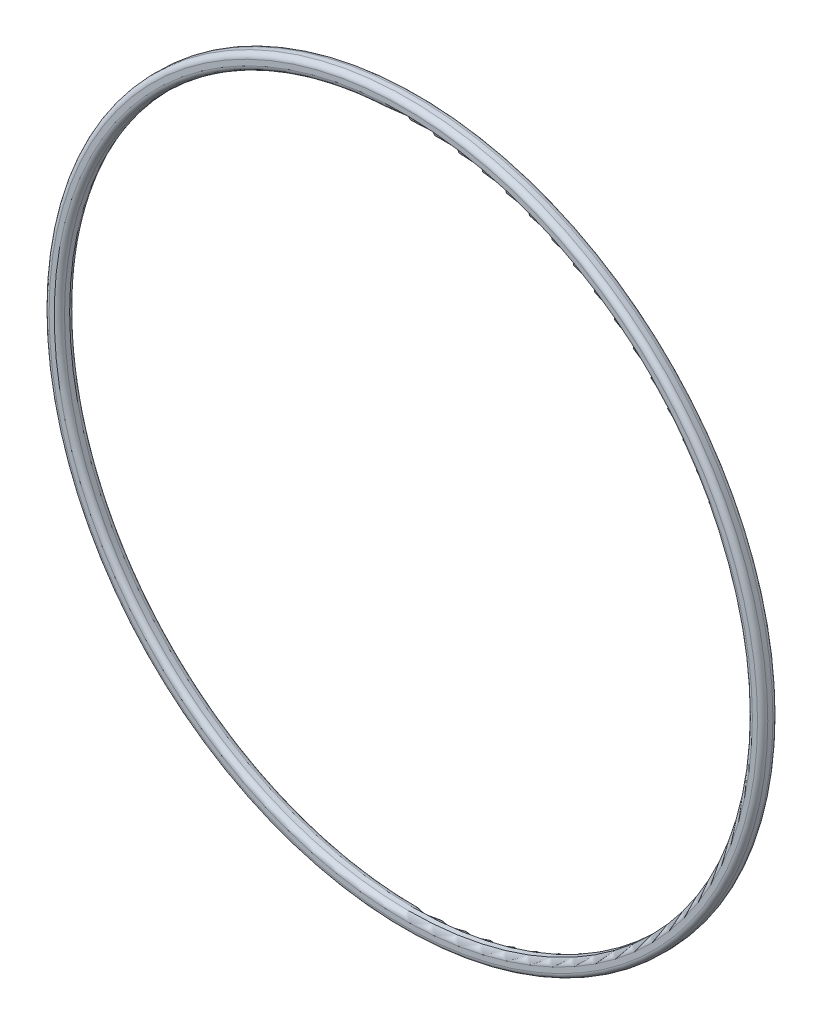
ISO-10303-21;
HEADER;
FILE_DESCRIPTION(('STEP AP214'),'2;1');
FILE_NAME('part.step','',(''),(''),'','','');
FILE_SCHEMA(('AUTOMOTIVE_DESIGN { 1 0 10303 214 1 1 1 1 }'));
ENDSEC;
DATA;
#1=APPLICATION_CONTEXT('core data for automotive mechanical design processes');
#2=APPLICATION_PROTOCOL_DEFINITION('international standard','automotive_design',2000,#1);
#3=PRODUCT_CONTEXT('',#1,'mechanical');
#4=PRODUCT('Part','Part','',(#3));
#5=PRODUCT_RELATED_PRODUCT_CATEGORY('part','',(#4));
#6=PRODUCT_DEFINITION_FORMATION('','',#4);
#7=PRODUCT_DEFINITION_CONTEXT('part definition',#1,'design');
#8=PRODUCT_DEFINITION('design','',#6,#7);
#9=PRODUCT_DEFINITION_SHAPE('','',#8);
#10=(LENGTH_UNIT() NAMED_UNIT(*) SI_UNIT(.MILLI.,.METRE.));
#11=(NAMED_UNIT(*) PLANE_ANGLE_UNIT() SI_UNIT($,.RADIAN.));
#12=(NAMED_UNIT(*) SI_UNIT($,.STERADIAN.) SOLID_ANGLE_UNIT());
#13=UNCERTAINTY_MEASURE_WITH_UNIT(LENGTH_MEASURE(1.E-05),#10,'distance_accuracy_value','');
#14=(GEOMETRIC_REPRESENTATION_CONTEXT(3) GLOBAL_UNCERTAINTY_ASSIGNED_CONTEXT((#13)) GLOBAL_UNIT_ASSIGNED_CONTEXT((#10,
#11,#12)) REPRESENTATION_CONTEXT('',''));
#15=CARTESIAN_POINT('',(0.,0.,0.));
#16=DIRECTION('',(0.,0.,1.));
#17=DIRECTION('',(1.,0.,0.));
#18=AXIS2_PLACEMENT_3D('',#15,#16,#17);
#19=CARTESIAN_POINT('',(0.,0.,3.));
#20=DIRECTION('',(0.,0.,1.));
#21=DIRECTION('',(1.,0.,0.));
#22=AXIS2_PLACEMENT_3D('',#19,#20,#21);
#23=PLANE('',#22);
#24=CARTESIAN_POINT('',(0.,0.,3.));
#25=DIRECTION('',(0.,0.,1.));
#26=DIRECTION('',(1.,0.,0.));
#27=AXIS2_PLACEMENT_3D('',#24,#25,#26);
#28=CIRCLE('',#27,68.);
#29=CARTESIAN_POINT('',(68.,0.,3.));
#30=VERTEX_POINT('',#29);
#31=EDGE_CURVE('E10',#30,#30,#28,.F.);
#32=ORIENTED_EDGE('',*,*,#31,.T.);
#33=EDGE_LOOP('',(#32));
#34=FACE_BOUND('',#33,.T.);
#35=CARTESIAN_POINT('',(0.,0.,3.));
#36=DIRECTION('',(0.,0.,1.));
#37=DIRECTION('',(1.,0.,0.));
#38=AXIS2_PLACEMENT_3D('',#35,#36,#37);
#39=CIRCLE('',#38,69.);
#40=CARTESIAN_POINT('',(69.,0.,3.));
#41=VERTEX_POINT('',#40);
#42=EDGE_CURVE('E45',#41,#41,#39,.T.);
#43=ORIENTED_EDGE('',*,*,#42,.T.);
#44=EDGE_LOOP('',(#43));
#45=FACE_BOUND('',#44,.T.);
#46=ADVANCED_FACE('F37',(#34,#45),#23,.T.);
#47=CARTESIAN_POINT('',(0.,0.,0.));
#48=DIRECTION('',(0.,0.,1.));
#49=DIRECTION('',(1.,0.,0.));
#50=AXIS2_PLACEMENT_3D('',#47,#48,#49);
#51=PLANE('',#50);
#52=CARTESIAN_POINT('',(0.,0.,0.));
#53=DIRECTION('',(0.,0.,1.));
#54=DIRECTION('',(1.,0.,0.));
#55=AXIS2_PLACEMENT_3D('',#52,#53,#54);
#56=CIRCLE('',#55,68.);
#57=CARTESIAN_POINT('',(68.,0.,0.));
#58=VERTEX_POINT('',#57);
#59=EDGE_CURVE('E69',#58,#58,#56,.T.);
#60=ORIENTED_EDGE('',*,*,#59,.T.);
#61=EDGE_LOOP('',(#60));
#62=FACE_BOUND('',#61,.T.);
#63=CARTESIAN_POINT('',(0.,0.,0.));
#64=DIRECTION('',(0.,0.,1.));
#65=DIRECTION('',(1.,0.,0.));
#66=AXIS2_PLACEMENT_3D('',#63,#64,#65);
#67=CIRCLE('',#66,69.);
#68=CARTESIAN_POINT('',(69.,0.,0.));
#69=VERTEX_POINT('',#68);
#70=EDGE_CURVE('E73',#69,#69,#67,.F.);
#71=ORIENTED_EDGE('',*,*,#70,.T.);
#72=EDGE_LOOP('',(#71));
#73=FACE_BOUND('',#72,.T.);
#74=ADVANCED_FACE('F78',(#62,#73),#51,.F.);
#75=CARTESIAN_POINT('',(0.,0.,3.));
#76=DIRECTION('',(0.,0.,-1.));
#77=DIRECTION('',(-1.,0.,0.));
#78=AXIS2_PLACEMENT_3D('',#75,#76,#77);
#79=CYLINDRICAL_SURFACE('',#78,70.);
#80=CARTESIAN_POINT('',(0.,0.,1.));
#81=DIRECTION('',(0.,0.,1.));
#82=DIRECTION('',(1.,0.,0.));
#83=AXIS2_PLACEMENT_3D('',#80,#81,#82);
#84=CIRCLE('',#83,70.);
#85=CARTESIAN_POINT('',(70.,0.,1.));
#86=VERTEX_POINT('',#85);
#87=EDGE_CURVE('E50',#86,#86,#84,.T.);
#88=ORIENTED_EDGE('',*,*,#87,.T.);
#89=EDGE_LOOP('',(#88));
#90=FACE_BOUND('',#89,.T.);
#91=CARTESIAN_POINT('',(0.,0.,2.));
#92=DIRECTION('',(0.,0.,1.));
#93=DIRECTION('',(1.,0.,0.));
#94=AXIS2_PLACEMENT_3D('',#91,#92,#93);
#95=CIRCLE('',#94,70.);
#96=CARTESIAN_POINT('',(70.,0.,2.));
#97=VERTEX_POINT('',#96);
#98=EDGE_CURVE('E55',#97,#97,#95,.F.);
#99=ORIENTED_EDGE('',*,*,#98,.T.);
#100=EDGE_LOOP('',(#99));
#101=FACE_BOUND('',#100,.T.);
#102=ADVANCED_FACE('F88',(#90,#101),#79,.T.);
#103=CARTESIAN_POINT('',(0.,0.,3.));
#104=DIRECTION('',(0.,0.,-1.));
#105=DIRECTION('',(-1.,0.,0.));
#106=AXIS2_PLACEMENT_3D('',#103,#104,#105);
#107=CYLINDRICAL_SURFACE('',#106,67.);
#108=CARTESIAN_POINT('',(0.,0.,1.));
#109=DIRECTION('',(0.,0.,1.));
#110=DIRECTION('',(1.,0.,0.));
#111=AXIS2_PLACEMENT_3D('',#108,#109,#110);
#112=CIRCLE('',#111,67.);
#113=CARTESIAN_POINT('',(67.,0.,1.));
#114=VERTEX_POINT('',#113);
#115=EDGE_CURVE('E61',#114,#114,#112,.F.);
#116=ORIENTED_EDGE('',*,*,#115,.T.);
#117=EDGE_LOOP('',(#116));
#118=FACE_BOUND('',#117,.T.);
#119=CARTESIAN_POINT('',(0.,0.,2.));
#120=DIRECTION('',(0.,0.,1.));
#121=DIRECTION('',(1.,0.,0.));
#122=AXIS2_PLACEMENT_3D('',#119,#120,#121);
#123=CIRCLE('',#122,67.);
#124=CARTESIAN_POINT('',(67.,0.,2.));
#125=VERTEX_POINT('',#124);
#126=EDGE_CURVE('E65',#125,#125,#123,.T.);
#127=ORIENTED_EDGE('',*,*,#126,.T.);
#128=EDGE_LOOP('',(#127));
#129=FACE_BOUND('',#128,.T.);
#130=ADVANCED_FACE('F91',(#118,#129),#107,.F.);
#131=CARTESIAN_POINT('',(0.,0.,1.));
#132=DIRECTION('',(0.,0.,1.));
#133=DIRECTION('',(1.,0.,0.));
#134=AXIS2_PLACEMENT_3D('',#131,#132,#133);
#135=TOROIDAL_SURFACE('',#134,68.,1.);
#136=ORIENTED_EDGE('',*,*,#115,.F.);
#137=EDGE_LOOP('',(#136));
#138=FACE_BOUND('',#137,.T.);
#139=ORIENTED_EDGE('',*,*,#59,.F.);
#140=EDGE_LOOP('',(#139));
#141=FACE_BOUND('',#140,.T.);
#142=ADVANCED_FACE('F84',(#138,#141),#135,.T.);
#143=CARTESIAN_POINT('',(0.,0.,1.));
#144=DIRECTION('',(0.,0.,1.));
#145=DIRECTION('',(1.,0.,0.));
#146=AXIS2_PLACEMENT_3D('',#143,#144,#145);
#147=TOROIDAL_SURFACE('',#146,69.,1.);
#148=ORIENTED_EDGE('',*,*,#70,.F.);
#149=EDGE_LOOP('',(#148));
#150=FACE_BOUND('',#149,.T.);
#151=ORIENTED_EDGE('',*,*,#87,.F.);
#152=EDGE_LOOP('',(#151));
#153=FACE_BOUND('',#152,.T.);
#154=ADVANCED_FACE('F80',(#150,#153),#147,.T.);
#155=CARTESIAN_POINT('',(0.,0.,2.));
#156=DIRECTION('',(0.,0.,1.));
#157=DIRECTION('',(1.,0.,0.));
#158=AXIS2_PLACEMENT_3D('',#155,#156,#157);
#159=TOROIDAL_SURFACE('',#158,68.,1.);
#160=ORIENTED_EDGE('',*,*,#31,.F.);
#161=EDGE_LOOP('',(#160));
#162=FACE_BOUND('',#161,.T.);
#163=ORIENTED_EDGE('',*,*,#126,.F.);
#164=EDGE_LOOP('',(#163));
#165=FACE_BOUND('',#164,.T.);
#166=ADVANCED_FACE('F83',(#162,#165),#159,.T.);
#167=CARTESIAN_POINT('',(0.,0.,2.));
#168=DIRECTION('',(0.,0.,1.));
#169=DIRECTION('',(1.,0.,0.));
#170=AXIS2_PLACEMENT_3D('',#167,#168,#169);
#171=TOROIDAL_SURFACE('',#170,69.,1.);
#172=ORIENTED_EDGE('',*,*,#98,.F.);
#173=EDGE_LOOP('',(#172));
#174=FACE_BOUND('',#173,.T.);
#175=ORIENTED_EDGE('',*,*,#42,.F.);
#176=EDGE_LOOP('',(#175));
#177=FACE_BOUND('',#176,.T.);
#178=ADVANCED_FACE('F39',(#174,#177),#171,.T.);
#179=CLOSED_SHELL('',(#46,#74,#102,#130,#142,#154,#166,#178));
#180=MANIFOLD_SOLID_BREP('B2',#179);
#181=ADVANCED_BREP_SHAPE_REPRESENTATION('',(#18,#180),#14);
#182=SHAPE_DEFINITION_REPRESENTATION(#9,#181);
ENDSEC;
END-ISO-10303-21;
